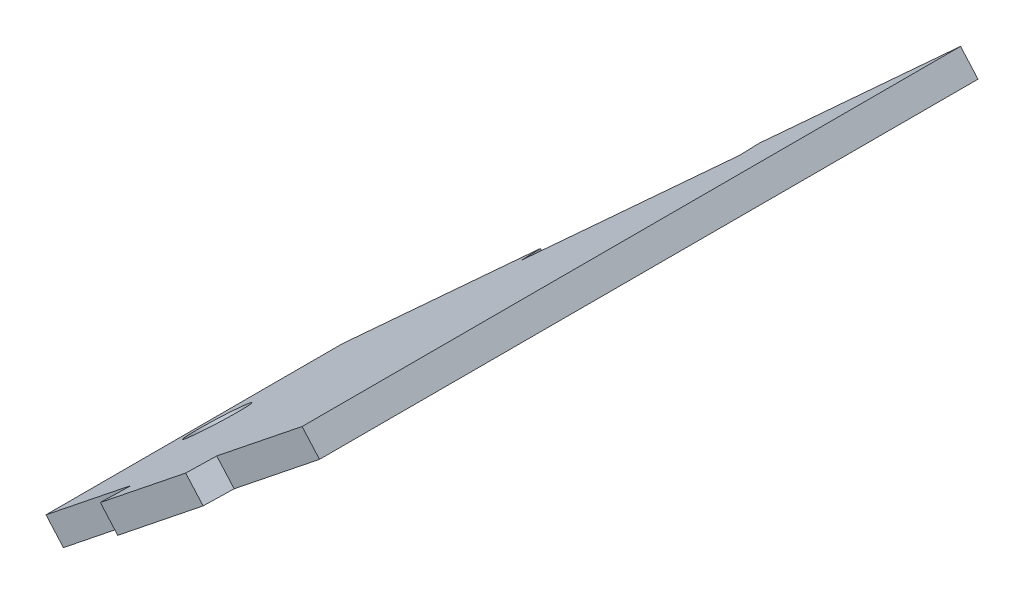
ISO-10303-21;
HEADER;
FILE_DESCRIPTION(('STEP AP214'),'2;1');
FILE_NAME('part.step','',(''),(''),'','','');
FILE_SCHEMA(('AUTOMOTIVE_DESIGN { 1 0 10303 214 1 1 1 1 }'));
ENDSEC;
DATA;
#1=APPLICATION_CONTEXT('core data for automotive mechanical design processes');
#2=APPLICATION_PROTOCOL_DEFINITION('international standard','automotive_design',2000,#1);
#3=PRODUCT_CONTEXT('',#1,'mechanical');
#4=PRODUCT('Part','Part','',(#3));
#5=PRODUCT_RELATED_PRODUCT_CATEGORY('part','',(#4));
#6=PRODUCT_DEFINITION_FORMATION('','',#4);
#7=PRODUCT_DEFINITION_CONTEXT('part definition',#1,'design');
#8=PRODUCT_DEFINITION('design','',#6,#7);
#9=PRODUCT_DEFINITION_SHAPE('','',#8);
#10=(LENGTH_UNIT() NAMED_UNIT(*) SI_UNIT(.MILLI.,.METRE.));
#11=(NAMED_UNIT(*) PLANE_ANGLE_UNIT() SI_UNIT($,.RADIAN.));
#12=(NAMED_UNIT(*) SI_UNIT($,.STERADIAN.) SOLID_ANGLE_UNIT());
#13=UNCERTAINTY_MEASURE_WITH_UNIT(LENGTH_MEASURE(1.E-05),#10,'distance_accuracy_value','');
#14=(GEOMETRIC_REPRESENTATION_CONTEXT(3) GLOBAL_UNCERTAINTY_ASSIGNED_CONTEXT((#13)) GLOBAL_UNIT_ASSIGNED_CONTEXT((#10,
#11,#12)) REPRESENTATION_CONTEXT('',''));
#15=CARTESIAN_POINT('',(0.,0.,0.));
#16=DIRECTION('',(0.,0.,1.));
#17=DIRECTION('',(1.,0.,0.));
#18=AXIS2_PLACEMENT_3D('',#15,#16,#17);
#19=CARTESIAN_POINT('',(22.7862879053032,-1.19994239043795,-10.6754226985341));
#20=DIRECTION('',(0.749963994023717,0.661478652465817,0.));
#21=DIRECTION('',(-0.661478652465817,0.749963994023717,0.));
#22=AXIS2_PLACEMENT_3D('',#19,#20,#21);
#23=PLANE('',#22);
#24=DIRECTION('',(0.,0.,-1.));
#25=VECTOR('',#24,1.);
#26=CARTESIAN_POINT('',(21.7279220613579,0.,-10.6754226985341));
#27=LINE('',#26,#25);
#28=CARTESIAN_POINT('',(21.7279220613579,0.,7.32457730146589));
#29=VERTEX_POINT('',#28);
#30=CARTESIAN_POINT('',(21.7279220613579,0.,-10.6754226985341));
#31=VERTEX_POINT('',#30);
#32=EDGE_CURVE('E99',#29,#31,#27,.T.);
#33=ORIENTED_EDGE('',*,*,#32,.T.);
#34=DIRECTION('',(-0.661478652465817,0.749963994023718,0.));
#35=VECTOR('',#34,1.);
#36=CARTESIAN_POINT('',(22.7862879053032,-1.19994239043795,-10.6754226985341));
#37=LINE('',#36,#35);
#38=CARTESIAN_POINT('',(22.7862879053032,-1.19994239043795,-10.6754226985341));
#39=VERTEX_POINT('',#38);
#40=EDGE_CURVE('E11',#39,#31,#37,.T.);
#41=ORIENTED_EDGE('',*,*,#40,.F.);
#42=DIRECTION('',(0.,0.,-1.));
#43=VECTOR('',#42,1.);
#44=CARTESIAN_POINT('',(22.7862879053032,-1.19994239043795,-9.));
#45=LINE('',#44,#43);
#46=CARTESIAN_POINT('',(22.7862879053032,-1.19994239043795,7.32457730146589));
#47=VERTEX_POINT('',#46);
#48=EDGE_CURVE('E105',#47,#39,#45,.T.);
#49=ORIENTED_EDGE('',*,*,#48,.F.);
#50=DIRECTION('',(-0.661478652465817,0.749963994023718,0.));
#51=VECTOR('',#50,1.);
#52=CARTESIAN_POINT('',(22.7862879053032,-1.19994239043795,7.32457730146589));
#53=LINE('',#52,#51);
#54=EDGE_CURVE('E151',#47,#29,#53,.T.);
#55=ORIENTED_EDGE('',*,*,#54,.T.);
#56=EDGE_LOOP('',(#33,#41,#49,#55));
#57=FACE_BOUND('',#56,.T.);
#58=ADVANCED_FACE('F34',(#57),#23,.F.);
#59=CARTESIAN_POINT('',(31.2993089146626,6.30866030323506,-14.2016314573778));
#60=DIRECTION('',(0.222484996370314,0.196234854960575,0.954982883662688));
#61=DIRECTION('',(0.973918861866332,0.,-0.226896563440237));
#62=AXIS2_PLACEMENT_3D('',#59,#60,#61);
#63=PLANE('',#62);
#64=DIRECTION('',(0.716202777655957,0.631700791013115,-0.296660903914379));
#65=VECTOR('',#64,1.);
#66=CARTESIAN_POINT('',(30.2409430707173,7.508602693673,-14.2016314573778));
#67=LINE('',#66,#65);
#68=CARTESIAN_POINT('',(30.2409430707173,7.508602693673,-14.2016314573778));
#69=VERTEX_POINT('',#68);
#70=EDGE_CURVE('E156',#31,#69,#67,.T.);
#71=ORIENTED_EDGE('',*,*,#70,.T.);
#72=DIRECTION('',(-0.661478652465817,0.749963994023718,0.));
#73=VECTOR('',#72,1.);
#74=CARTESIAN_POINT('',(31.2993089146626,6.30866030323506,-14.2016314573778));
#75=LINE('',#74,#73);
#76=CARTESIAN_POINT('',(31.2993089146626,6.30866030323506,-14.2016314573778));
#77=VERTEX_POINT('',#76);
#78=EDGE_CURVE('E43',#77,#69,#75,.T.);
#79=ORIENTED_EDGE('',*,*,#78,.F.);
#80=DIRECTION('',(0.716202777655957,0.631700791013115,-0.296660903914379));
#81=VECTOR('',#80,1.);
#82=CARTESIAN_POINT('',(31.2993089146626,6.30866030323506,-14.2016314573778));
#83=LINE('',#82,#81);
#84=EDGE_CURVE('E245',#39,#77,#83,.T.);
#85=ORIENTED_EDGE('',*,*,#84,.F.);
#86=ORIENTED_EDGE('',*,*,#40,.T.);
#87=EDGE_LOOP('',(#71,#79,#85,#86));
#88=FACE_BOUND('',#87,.T.);
#89=ADVANCED_FACE('F250',(#88),#63,.F.);
#90=CARTESIAN_POINT('',(31.6552849088551,6.62263607117198,-12.6736588435175));
#91=DIRECTION('',(-0.716202777655957,-0.631700791013115,0.296660903914379));
#92=DIRECTION('',(0.661478652465817,-0.749963994023717,0.));
#93=AXIS2_PLACEMENT_3D('',#90,#91,#92);
#94=PLANE('',#93);
#95=DIRECTION('',(0.222484996370313,0.196234854960575,0.954982883662688));
#96=VECTOR('',#95,1.);
#97=CARTESIAN_POINT('',(30.5969190649098,7.82257846160992,-12.6736588435175));
#98=LINE('',#97,#96);
#99=CARTESIAN_POINT('',(30.5969190649098,7.82257846160992,-12.6736588435175));
#100=VERTEX_POINT('',#99);
#101=EDGE_CURVE('E158',#69,#100,#98,.T.);
#102=ORIENTED_EDGE('',*,*,#101,.T.);
#103=DIRECTION('',(-0.661478652465817,0.749963994023718,0.));
#104=VECTOR('',#103,1.);
#105=CARTESIAN_POINT('',(31.6552849088551,6.62263607117198,-12.6736588435175));
#106=LINE('',#105,#104);
#107=CARTESIAN_POINT('',(31.6552849088551,6.62263607117198,-12.6736588435175));
#108=VERTEX_POINT('',#107);
#109=EDGE_CURVE('E195',#108,#100,#106,.T.);
#110=ORIENTED_EDGE('',*,*,#109,.F.);
#111=DIRECTION('',(0.222484996370313,0.196234854960575,0.954982883662688));
#112=VECTOR('',#111,1.);
#113=CARTESIAN_POINT('',(31.6552849088551,6.62263607117198,-12.6736588435175));
#114=LINE('',#113,#112);
#115=EDGE_CURVE('E205',#77,#108,#114,.T.);
#116=ORIENTED_EDGE('',*,*,#115,.F.);
#117=ORIENTED_EDGE('',*,*,#78,.T.);
#118=EDGE_LOOP('',(#102,#110,#116,#117));
#119=FACE_BOUND('',#118,.T.);
#120=ADVANCED_FACE('F203',(#119),#94,.F.);
#121=CARTESIAN_POINT('',(41.0445533874651,14.9041011953154,-16.56282118812));
#122=DIRECTION('',(0.222484996370314,0.196234854960575,0.954982883662688));
#123=DIRECTION('',(0.973918861866332,0.,-0.226896563440236));
#124=AXIS2_PLACEMENT_3D('',#121,#122,#123);
#125=PLANE('',#124);
#126=DIRECTION('',(0.716202777655957,0.631700791013115,-0.296660903914379));
#127=VECTOR('',#126,1.);
#128=CARTESIAN_POINT('',(39.9861875435198,16.1040435857533,-16.56282118812));
#129=LINE('',#128,#127);
#130=CARTESIAN_POINT('',(39.9861875435198,16.1040435857533,-16.56282118812));
#131=VERTEX_POINT('',#130);
#132=EDGE_CURVE('E160',#100,#131,#129,.T.);
#133=ORIENTED_EDGE('',*,*,#132,.T.);
#134=DIRECTION('',(-0.661478652465817,0.749963994023718,0.));
#135=VECTOR('',#134,1.);
#136=CARTESIAN_POINT('',(41.0445533874651,14.9041011953154,-16.56282118812));
#137=LINE('',#136,#135);
#138=CARTESIAN_POINT('',(41.0445533874651,14.9041011953154,-16.56282118812));
#139=VERTEX_POINT('',#138);
#140=EDGE_CURVE('E192',#139,#131,#137,.T.);
#141=ORIENTED_EDGE('',*,*,#140,.F.);
#142=DIRECTION('',(0.716202777655957,0.631700791013115,-0.296660903914379));
#143=VECTOR('',#142,1.);
#144=CARTESIAN_POINT('',(41.0445533874651,14.9041011953154,-16.56282118812));
#145=LINE('',#144,#143);
#146=EDGE_CURVE('E223',#108,#139,#145,.T.);
#147=ORIENTED_EDGE('',*,*,#146,.F.);
#148=ORIENTED_EDGE('',*,*,#109,.T.);
#149=EDGE_LOOP('',(#133,#141,#147,#148));
#150=FACE_BOUND('',#149,.T.);
#151=ADVANCED_FACE('F214',(#150),#125,.F.);
#152=CARTESIAN_POINT('',(40.6885773932726,14.5901254273785,-18.0907938019803));
#153=DIRECTION('',(0.716202777655957,0.631700791013115,-0.296660903914378));
#154=DIRECTION('',(-0.661478652465817,0.749963994023717,0.));
#155=AXIS2_PLACEMENT_3D('',#152,#153,#154);
#156=PLANE('',#155);
#157=DIRECTION('',(-0.222484996370313,-0.196234854960575,-0.954982883662688));
#158=VECTOR('',#157,1.);
#159=CARTESIAN_POINT('',(39.6302115493273,15.7900678178164,-18.0907938019803));
#160=LINE('',#159,#158);
#161=CARTESIAN_POINT('',(39.6302115493273,15.7900678178164,-18.0907938019803));
#162=VERTEX_POINT('',#161);
#163=EDGE_CURVE('E162',#131,#162,#160,.T.);
#164=ORIENTED_EDGE('',*,*,#163,.T.);
#165=DIRECTION('',(-0.661478652465817,0.749963994023718,0.));
#166=VECTOR('',#165,1.);
#167=CARTESIAN_POINT('',(40.6885773932726,14.5901254273785,-18.0907938019803));
#168=LINE('',#167,#166);
#169=CARTESIAN_POINT('',(40.6885773932726,14.5901254273785,-18.0907938019803));
#170=VERTEX_POINT('',#169);
#171=EDGE_CURVE('E189',#170,#162,#168,.T.);
#172=ORIENTED_EDGE('',*,*,#171,.F.);
#173=DIRECTION('',(-0.222484996370313,-0.196234854960575,-0.954982883662688));
#174=VECTOR('',#173,1.);
#175=CARTESIAN_POINT('',(40.6885773932726,14.5901254273785,-18.0907938019803));
#176=LINE('',#175,#174);
#177=EDGE_CURVE('E220',#139,#170,#176,.T.);
#178=ORIENTED_EDGE('',*,*,#177,.F.);
#179=ORIENTED_EDGE('',*,*,#140,.T.);
#180=EDGE_LOOP('',(#164,#172,#178,#179));
#181=FACE_BOUND('',#180,.T.);
#182=ADVANCED_FACE('F218',(#181),#156,.F.);
#183=CARTESIAN_POINT('',(49.3426370914072,22.2231262022128,-21.6754226985341));
#184=DIRECTION('',(0.222484996370314,0.196234854960575,0.954982883662688));
#185=DIRECTION('',(0.973918861866331,0.,-0.226896563440237));
#186=AXIS2_PLACEMENT_3D('',#183,#184,#185);
#187=PLANE('',#186);
#188=DIRECTION('',(0.716202777655957,0.631700791013115,-0.296660903914379));
#189=VECTOR('',#188,1.);
#190=CARTESIAN_POINT('',(48.2842712474619,23.4230685926507,-21.6754226985341));
#191=LINE('',#190,#189);
#192=CARTESIAN_POINT('',(48.2842712474619,23.4230685926507,-21.6754226985341));
#193=VERTEX_POINT('',#192);
#194=EDGE_CURVE('E164',#162,#193,#191,.T.);
#195=ORIENTED_EDGE('',*,*,#194,.T.);
#196=DIRECTION('',(-0.661478652465817,0.749963994023718,0.));
#197=VECTOR('',#196,1.);
#198=CARTESIAN_POINT('',(49.3426370914072,22.2231262022128,-21.6754226985341));
#199=LINE('',#198,#197);
#200=CARTESIAN_POINT('',(49.3426370914072,22.2231262022128,-21.6754226985341));
#201=VERTEX_POINT('',#200);
#202=EDGE_CURVE('E186',#201,#193,#199,.T.);
#203=ORIENTED_EDGE('',*,*,#202,.F.);
#204=DIRECTION('',(0.716202777655957,0.631700791013115,-0.296660903914379));
#205=VECTOR('',#204,1.);
#206=CARTESIAN_POINT('',(49.3426370914072,22.2231262022128,-21.6754226985341));
#207=LINE('',#206,#205);
#208=EDGE_CURVE('E222',#170,#201,#207,.T.);
#209=ORIENTED_EDGE('',*,*,#208,.F.);
#210=ORIENTED_EDGE('',*,*,#171,.T.);
#211=EDGE_LOOP('',(#195,#203,#209,#210));
#212=FACE_BOUND('',#211,.T.);
#213=ADVANCED_FACE('F262',(#212),#187,.F.);
#214=CARTESIAN_POINT('',(49.3426370914072,22.2231262022128,18.3245773014659));
#215=DIRECTION('',(-0.749963994023718,-0.661478652465817,0.));
#216=DIRECTION('',(0.661478652465817,-0.749963994023718,0.));
#217=AXIS2_PLACEMENT_3D('',#214,#215,#216);
#218=PLANE('',#217);
#219=DIRECTION('',(0.,0.,1.));
#220=VECTOR('',#219,1.);
#221=CARTESIAN_POINT('',(48.2842712474619,23.4230685926507,18.3245773014659));
#222=LINE('',#221,#220);
#223=CARTESIAN_POINT('',(48.2842712474619,23.4230685926507,18.3245773014659));
#224=VERTEX_POINT('',#223);
#225=EDGE_CURVE('E166',#193,#224,#222,.T.);
#226=ORIENTED_EDGE('',*,*,#225,.T.);
#227=DIRECTION('',(-0.661478652465817,0.749963994023718,0.));
#228=VECTOR('',#227,1.);
#229=CARTESIAN_POINT('',(49.3426370914072,22.2231262022128,18.3245773014659));
#230=LINE('',#229,#228);
#231=CARTESIAN_POINT('',(49.3426370914072,22.2231262022128,18.3245773014659));
#232=VERTEX_POINT('',#231);
#233=EDGE_CURVE('E183',#232,#224,#230,.T.);
#234=ORIENTED_EDGE('',*,*,#233,.F.);
#235=DIRECTION('',(0.,0.,1.));
#236=VECTOR('',#235,1.);
#237=CARTESIAN_POINT('',(49.3426370914072,22.2231262022128,18.3245773014659));
#238=LINE('',#237,#236);
#239=EDGE_CURVE('E225',#201,#232,#238,.T.);
#240=ORIENTED_EDGE('',*,*,#239,.F.);
#241=ORIENTED_EDGE('',*,*,#202,.T.);
#242=EDGE_LOOP('',(#226,#234,#240,#241));
#243=FACE_BOUND('',#242,.T.);
#244=ADVANCED_FACE('F265',(#243),#218,.F.);
#245=CARTESIAN_POINT('',(40.4905206960392,14.4154366713292,14.6579106347993));
#246=DIRECTION('',(0.222484996370315,0.196234854960575,-0.954982883662688));
#247=DIRECTION('',(-0.973918861866331,0.,-0.226896563440237));
#248=AXIS2_PLACEMENT_3D('',#245,#246,#247);
#249=PLANE('',#248);
#250=DIRECTION('',(-0.716202777655956,-0.631700791013115,-0.29666090391438));
#251=VECTOR('',#250,1.);
#252=CARTESIAN_POINT('',(39.4321548520939,15.6153790617671,14.6579106347993));
#253=LINE('',#252,#251);
#254=CARTESIAN_POINT('',(39.4321548520939,15.6153790617671,14.6579106347993));
#255=VERTEX_POINT('',#254);
#256=EDGE_CURVE('E168',#224,#255,#253,.T.);
#257=ORIENTED_EDGE('',*,*,#256,.T.);
#258=DIRECTION('',(-0.661478652465817,0.749963994023718,0.));
#259=VECTOR('',#258,1.);
#260=CARTESIAN_POINT('',(40.4905206960392,14.4154366713292,14.6579106347993));
#261=LINE('',#260,#259);
#262=CARTESIAN_POINT('',(40.4905206960392,14.4154366713292,14.6579106347993));
#263=VERTEX_POINT('',#262);
#264=EDGE_CURVE('E180',#263,#255,#261,.T.);
#265=ORIENTED_EDGE('',*,*,#264,.F.);
#266=DIRECTION('',(-0.716202777655956,-0.631700791013115,-0.29666090391438));
#267=VECTOR('',#266,1.);
#268=CARTESIAN_POINT('',(40.4905206960392,14.4154366713292,14.6579106347993));
#269=LINE('',#268,#267);
#270=EDGE_CURVE('E231',#232,#263,#269,.T.);
#271=ORIENTED_EDGE('',*,*,#270,.F.);
#272=ORIENTED_EDGE('',*,*,#233,.T.);
#273=EDGE_LOOP('',(#257,#265,#271,#272));
#274=FACE_BOUND('',#273,.T.);
#275=ADVANCED_FACE('F237',(#274),#249,.F.);
#276=CARTESIAN_POINT('',(40.1345447018467,14.1014609033923,16.1858832486596));
#277=DIRECTION('',(-0.716202777655957,-0.631700791013116,-0.296660903914377));
#278=DIRECTION('',(0.661478652465817,-0.749963994023717,0.));
#279=AXIS2_PLACEMENT_3D('',#276,#277,#278);
#280=PLANE('',#279);
#281=DIRECTION('',(-0.222484996370313,-0.196234854960573,0.954982883662689));
#282=VECTOR('',#281,1.);
#283=CARTESIAN_POINT('',(39.0761788579014,15.3014032938302,16.1858832486596));
#284=LINE('',#283,#282);
#285=CARTESIAN_POINT('',(39.0761788579014,15.3014032938302,16.1858832486596));
#286=VERTEX_POINT('',#285);
#287=EDGE_CURVE('E170',#255,#286,#284,.T.);
#288=ORIENTED_EDGE('',*,*,#287,.T.);
#289=DIRECTION('',(-0.661478652465817,0.749963994023718,0.));
#290=VECTOR('',#289,1.);
#291=CARTESIAN_POINT('',(40.1345447018467,14.1014609033923,16.1858832486596));
#292=LINE('',#291,#290);
#293=CARTESIAN_POINT('',(40.1345447018467,14.1014609033923,16.1858832486596));
#294=VERTEX_POINT('',#293);
#295=EDGE_CURVE('E146',#294,#286,#292,.T.);
#296=ORIENTED_EDGE('',*,*,#295,.F.);
#297=DIRECTION('',(-0.222484996370313,-0.196234854960573,0.954982883662689));
#298=VECTOR('',#297,1.);
#299=CARTESIAN_POINT('',(40.1345447018467,14.1014609033923,16.1858832486596));
#300=LINE('',#299,#298);
#301=EDGE_CURVE('E137',#263,#294,#300,.T.);
#302=ORIENTED_EDGE('',*,*,#301,.F.);
#303=ORIENTED_EDGE('',*,*,#264,.T.);
#304=EDGE_LOOP('',(#288,#296,#302,#303));
#305=FACE_BOUND('',#304,.T.);
#306=ADVANCED_FACE('F241',(#305),#280,.F.);
#307=CARTESIAN_POINT('',(31.2824283064787,6.2937713725087,12.5192165819929));
#308=DIRECTION('',(0.222484996370314,0.196234854960574,-0.954982883662688));
#309=DIRECTION('',(-0.973918861866332,0.,-0.226896563440236));
#310=AXIS2_PLACEMENT_3D('',#307,#308,#309);
#311=PLANE('',#310);
#312=DIRECTION('',(-0.716202777655957,-0.631700791013115,-0.296660903914378));
#313=VECTOR('',#312,1.);
#314=CARTESIAN_POINT('',(30.2240624625334,7.49371376294665,12.5192165819929));
#315=LINE('',#314,#313);
#316=CARTESIAN_POINT('',(30.2240624625334,7.49371376294665,12.5192165819929));
#317=VERTEX_POINT('',#316);
#318=EDGE_CURVE('E145',#286,#317,#315,.T.);
#319=ORIENTED_EDGE('',*,*,#318,.T.);
#320=DIRECTION('',(-0.661478652465817,0.749963994023718,0.));
#321=VECTOR('',#320,1.);
#322=CARTESIAN_POINT('',(31.2824283064787,6.2937713725087,12.5192165819929));
#323=LINE('',#322,#321);
#324=CARTESIAN_POINT('',(31.2824283064787,6.2937713725087,12.5192165819929));
#325=VERTEX_POINT('',#324);
#326=EDGE_CURVE('E142',#325,#317,#323,.T.);
#327=ORIENTED_EDGE('',*,*,#326,.F.);
#328=DIRECTION('',(-0.716202777655957,-0.631700791013115,-0.296660903914378));
#329=VECTOR('',#328,1.);
#330=CARTESIAN_POINT('',(31.2824283064787,6.2937713725087,12.5192165819929));
#331=LINE('',#330,#329);
#332=EDGE_CURVE('E131',#294,#325,#331,.T.);
#333=ORIENTED_EDGE('',*,*,#332,.F.);
#334=ORIENTED_EDGE('',*,*,#295,.T.);
#335=EDGE_LOOP('',(#319,#327,#333,#334));
#336=FACE_BOUND('',#335,.T.);
#337=ADVANCED_FACE('F143',(#336),#311,.F.);
#338=CARTESIAN_POINT('',(31.6384043006712,6.60774714044562,10.9912439681326));
#339=DIRECTION('',(0.716202777655957,0.631700791013115,0.296660903914379));
#340=DIRECTION('',(-0.661478652465817,0.749963994023717,0.));
#341=AXIS2_PLACEMENT_3D('',#338,#339,#340);
#342=PLANE('',#341);
#343=DIRECTION('',(0.222484996370313,0.196234854960575,-0.954982883662688));
#344=VECTOR('',#343,1.);
#345=CARTESIAN_POINT('',(30.5800384567259,7.80768953088357,10.9912439681326));
#346=LINE('',#345,#344);
#347=CARTESIAN_POINT('',(30.5800384567259,7.80768953088357,10.9912439681326));
#348=VERTEX_POINT('',#347);
#349=EDGE_CURVE('E92',#317,#348,#346,.T.);
#350=ORIENTED_EDGE('',*,*,#349,.T.);
#351=DIRECTION('',(-0.661478652465817,0.749963994023718,0.));
#352=VECTOR('',#351,1.);
#353=CARTESIAN_POINT('',(31.6384043006712,6.60774714044562,10.9912439681326));
#354=LINE('',#353,#352);
#355=CARTESIAN_POINT('',(31.6384043006712,6.60774714044562,10.9912439681326));
#356=VERTEX_POINT('',#355);
#357=EDGE_CURVE('E147',#356,#348,#354,.T.);
#358=ORIENTED_EDGE('',*,*,#357,.F.);
#359=DIRECTION('',(0.222484996370313,0.196234854960575,-0.954982883662688));
#360=VECTOR('',#359,1.);
#361=CARTESIAN_POINT('',(31.6384043006712,6.60774714044562,10.9912439681326));
#362=LINE('',#361,#360);
#363=EDGE_CURVE('E135',#325,#356,#362,.T.);
#364=ORIENTED_EDGE('',*,*,#363,.F.);
#365=ORIENTED_EDGE('',*,*,#326,.T.);
#366=EDGE_LOOP('',(#350,#358,#364,#365));
#367=FACE_BOUND('',#366,.T.);
#368=ADVANCED_FACE('F149',(#367),#342,.F.);
#369=CARTESIAN_POINT('',(22.7862879053032,-1.19994239043795,7.32457730146589));
#370=DIRECTION('',(0.222484996370316,0.196234854960577,-0.954982883662687));
#371=DIRECTION('',(-0.973918861866331,0.,-0.226896563440239));
#372=AXIS2_PLACEMENT_3D('',#369,#370,#371);
#373=PLANE('',#372);
#374=DIRECTION('',(-0.716202777655956,-0.631700791013115,-0.296660903914382));
#375=VECTOR('',#374,1.);
#376=CARTESIAN_POINT('',(21.7279220613579,0.,7.32457730146589));
#377=LINE('',#376,#375);
#378=EDGE_CURVE('E174',#348,#29,#377,.T.);
#379=ORIENTED_EDGE('',*,*,#378,.T.);
#380=ORIENTED_EDGE('',*,*,#54,.F.);
#381=DIRECTION('',(-0.716202777655956,-0.631700791013115,-0.296660903914382));
#382=VECTOR('',#381,1.);
#383=CARTESIAN_POINT('',(22.7862879053032,-1.19994239043795,7.32457730146589));
#384=LINE('',#383,#382);
#385=EDGE_CURVE('E51',#356,#47,#384,.T.);
#386=ORIENTED_EDGE('',*,*,#385,.F.);
#387=ORIENTED_EDGE('',*,*,#357,.T.);
#388=EDGE_LOOP('',(#379,#380,#386,#387));
#389=FACE_BOUND('',#388,.T.);
#390=ADVANCED_FACE('F243',(#389),#373,.F.);
#391=CARTESIAN_POINT('',(10.5655052201902,-11.9788423470276,0.));
#392=DIRECTION('',(-0.661478652465817,0.749963994023717,0.));
#393=DIRECTION('',(-0.749963994023717,-0.661478652465817,0.));
#394=AXIS2_PLACEMENT_3D('',#391,#392,#393);
#395=PLANE('',#394);
#396=CARTESIAN_POINT('',(25.0361798873743,0.78449356695951,-0.837711349267052));
#397=DIRECTION('',(-0.661478652465817,0.749963994023717,0.));
#398=DIRECTION('',(-0.749963994023717,-0.661478652465817,0.));
#399=AXIS2_PLACEMENT_3D('',#396,#397,#398);
#400=CIRCLE('',#399,1.7);
#401=CARTESIAN_POINT('',(23.761241097534,-0.340020142232379,-0.837711349267052));
#402=VERTEX_POINT('',#401);
#403=EDGE_CURVE('E37',#402,#402,#400,.T.);
#404=ORIENTED_EDGE('',*,*,#403,.T.);
#405=EDGE_LOOP('',(#404));
#406=FACE_BOUND('',#405,.T.);
#407=ORIENTED_EDGE('',*,*,#48,.T.);
#408=ORIENTED_EDGE('',*,*,#84,.T.);
#409=ORIENTED_EDGE('',*,*,#115,.T.);
#410=ORIENTED_EDGE('',*,*,#146,.T.);
#411=ORIENTED_EDGE('',*,*,#177,.T.);
#412=ORIENTED_EDGE('',*,*,#208,.T.);
#413=ORIENTED_EDGE('',*,*,#239,.T.);
#414=ORIENTED_EDGE('',*,*,#270,.T.);
#415=ORIENTED_EDGE('',*,*,#301,.T.);
#416=ORIENTED_EDGE('',*,*,#332,.T.);
#417=ORIENTED_EDGE('',*,*,#363,.T.);
#418=ORIENTED_EDGE('',*,*,#385,.T.);
#419=EDGE_LOOP('',(#407,#408,#409,#410,#411,#412,#413,#414,#415,#416,#417,#418));
#420=FACE_BOUND('',#419,.T.);
#421=ADVANCED_FACE('F133',(#406,#420),#395,.F.);
#422=CARTESIAN_POINT('',(9.50713937624494,-10.7788999565897,0.));
#423=DIRECTION('',(-0.661478652465817,0.749963994023717,0.));
#424=DIRECTION('',(-0.749963994023717,-0.661478652465817,0.));
#425=AXIS2_PLACEMENT_3D('',#422,#423,#424);
#426=PLANE('',#425);
#427=CARTESIAN_POINT('',(23.977814043429,1.98443595739745,-0.837711349267052));
#428=DIRECTION('',(-0.661478652465817,0.749963994023717,0.));
#429=DIRECTION('',(-0.749963994023717,-0.661478652465817,0.));
#430=AXIS2_PLACEMENT_3D('',#427,#428,#429);
#431=CIRCLE('',#430,1.7);
#432=CARTESIAN_POINT('',(22.7028752535887,0.859922248205563,-0.837711349267052));
#433=VERTEX_POINT('',#432);
#434=EDGE_CURVE('E249',#433,#433,#431,.T.);
#435=ORIENTED_EDGE('',*,*,#434,.F.);
#436=EDGE_LOOP('',(#435));
#437=FACE_BOUND('',#436,.T.);
#438=ORIENTED_EDGE('',*,*,#32,.F.);
#439=ORIENTED_EDGE('',*,*,#378,.F.);
#440=ORIENTED_EDGE('',*,*,#349,.F.);
#441=ORIENTED_EDGE('',*,*,#318,.F.);
#442=ORIENTED_EDGE('',*,*,#287,.F.);
#443=ORIENTED_EDGE('',*,*,#256,.F.);
#444=ORIENTED_EDGE('',*,*,#225,.F.);
#445=ORIENTED_EDGE('',*,*,#194,.F.);
#446=ORIENTED_EDGE('',*,*,#163,.F.);
#447=ORIENTED_EDGE('',*,*,#132,.F.);
#448=ORIENTED_EDGE('',*,*,#101,.F.);
#449=ORIENTED_EDGE('',*,*,#70,.F.);
#450=EDGE_LOOP('',(#438,#439,#440,#441,#442,#443,#444,#445,#446,#447,#448,#449));
#451=FACE_BOUND('',#450,.T.);
#452=ADVANCED_FACE('F209',(#437,#451),#426,.T.);
#453=CARTESIAN_POINT('',(23.977814043429,1.98443595739745,-0.837711349267052));
#454=DIRECTION('',(-0.661478652465817,0.749963994023717,0.));
#455=DIRECTION('',(-0.749963994023717,-0.661478652465817,0.));
#456=AXIS2_PLACEMENT_3D('',#453,#454,#455);
#457=CYLINDRICAL_SURFACE('',#456,1.7);
#458=ORIENTED_EDGE('',*,*,#434,.T.);
#459=EDGE_LOOP('',(#458));
#460=FACE_BOUND('',#459,.T.);
#461=ORIENTED_EDGE('',*,*,#403,.F.);
#462=EDGE_LOOP('',(#461));
#463=FACE_BOUND('',#462,.T.);
#464=ADVANCED_FACE('F282',(#460,#463),#457,.F.);
#465=CLOSED_SHELL('',(#58,#89,#120,#151,#182,#213,#244,#275,#306,#337,#368,#390,#421,#452,#464));
#466=MANIFOLD_SOLID_BREP('B2',#465);
#467=ADVANCED_BREP_SHAPE_REPRESENTATION('',(#18,#466),#14);
#468=SHAPE_DEFINITION_REPRESENTATION(#9,#467);
ENDSEC;
END-ISO-10303-21;
